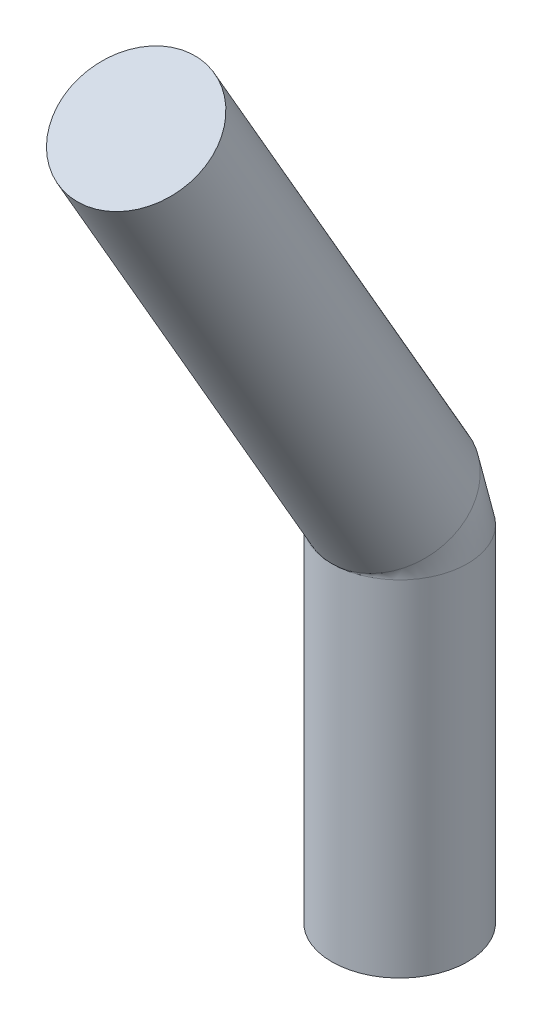
ISO-10303-21;
HEADER;
FILE_DESCRIPTION(('STEP AP214'),'2;1');
FILE_NAME('part.step','',(''),(''),'','','');
FILE_SCHEMA(('AUTOMOTIVE_DESIGN { 1 0 10303 214 1 1 1 1 }'));
ENDSEC;
DATA;
#1=APPLICATION_CONTEXT('core data for automotive mechanical design processes');
#2=APPLICATION_PROTOCOL_DEFINITION('international standard','automotive_design',2000,#1);
#3=PRODUCT_CONTEXT('',#1,'mechanical');
#4=PRODUCT('Part','Part','',(#3));
#5=PRODUCT_RELATED_PRODUCT_CATEGORY('part','',(#4));
#6=PRODUCT_DEFINITION_FORMATION('','',#4);
#7=PRODUCT_DEFINITION_CONTEXT('part definition',#1,'design');
#8=PRODUCT_DEFINITION('design','',#6,#7);
#9=PRODUCT_DEFINITION_SHAPE('','',#8);
#10=(LENGTH_UNIT() NAMED_UNIT(*) SI_UNIT(.MILLI.,.METRE.));
#11=(NAMED_UNIT(*) PLANE_ANGLE_UNIT() SI_UNIT($,.RADIAN.));
#12=(NAMED_UNIT(*) SI_UNIT($,.STERADIAN.) SOLID_ANGLE_UNIT());
#13=UNCERTAINTY_MEASURE_WITH_UNIT(LENGTH_MEASURE(1.E-05),#10,'distance_accuracy_value','');
#14=(GEOMETRIC_REPRESENTATION_CONTEXT(3) GLOBAL_UNCERTAINTY_ASSIGNED_CONTEXT((#13)) GLOBAL_UNIT_ASSIGNED_CONTEXT((#10,
#11,#12)) REPRESENTATION_CONTEXT('',''));
#15=CARTESIAN_POINT('',(0.,0.,0.));
#16=DIRECTION('',(0.,0.,1.));
#17=DIRECTION('',(1.,0.,0.));
#18=AXIS2_PLACEMENT_3D('',#15,#16,#17);
#19=CARTESIAN_POINT('',(0.,4.69711431702997,2.33038475772934));
#20=DIRECTION('',(0.,0.866025403784438,0.500000000000001));
#21=DIRECTION('',(0.,-0.500000000000001,0.866025403784438));
#22=AXIS2_PLACEMENT_3D('',#19,#20,#21);
#23=PLANE('',#22);
#24=CARTESIAN_POINT('',(0.,4.69711431702997,2.33038475772934));
#25=DIRECTION('',(0.,0.866025403784438,0.500000000000001));
#26=DIRECTION('',(0.,-0.500000000000001,0.866025403784438));
#27=AXIS2_PLACEMENT_3D('',#24,#25,#26);
#28=CIRCLE('',#27,0.6);
#29=CARTESIAN_POINT('',(0.,4.39711431702997,2.85000000000001));
#30=VERTEX_POINT('',#29);
#31=EDGE_CURVE('E11',#30,#30,#28,.T.);
#32=ORIENTED_EDGE('',*,*,#31,.T.);
#33=EDGE_LOOP('',(#32));
#34=FACE_BOUND('',#33,.T.);
#35=ADVANCED_FACE('F40',(#34),#23,.T.);
#36=CARTESIAN_POINT('',(0.,0.,0.));
#37=DIRECTION('',(0.,1.,0.));
#38=DIRECTION('',(0.,0.,1.));
#39=AXIS2_PLACEMENT_3D('',#36,#37,#38);
#40=CYLINDRICAL_SURFACE('',#39,0.6);
#41=CARTESIAN_POINT('',(0.,0.5,0.));
#42=DIRECTION('',(0.,1.,0.));
#43=DIRECTION('',(0.,0.,1.));
#44=AXIS2_PLACEMENT_3D('',#41,#42,#43);
#45=CIRCLE('',#44,0.6);
#46=CARTESIAN_POINT('',(0.,0.5,0.6));
#47=VERTEX_POINT('',#46);
#48=EDGE_CURVE('E51',#47,#47,#45,.T.);
#49=ORIENTED_EDGE('',*,*,#48,.F.);
#50=EDGE_LOOP('',(#49));
#51=FACE_BOUND('',#50,.T.);
#52=CARTESIAN_POINT('',(0.,-2.55,0.));
#53=DIRECTION('',(0.,-1.,0.));
#54=DIRECTION('',(0.,0.,-1.));
#55=AXIS2_PLACEMENT_3D('',#52,#53,#54);
#56=CIRCLE('',#55,0.6);
#57=CARTESIAN_POINT('',(0.,-2.55,-0.6));
#58=VERTEX_POINT('',#57);
#59=EDGE_CURVE('E58',#58,#58,#56,.T.);
#60=ORIENTED_EDGE('',*,*,#59,.F.);
#61=EDGE_LOOP('',(#60));
#62=FACE_BOUND('',#61,.T.);
#63=ADVANCED_FACE('F52',(#51,#62),#40,.T.);
#64=CARTESIAN_POINT('',(0.,0.5,0.6));
#65=DIRECTION('',(1.,0.,0.));
#66=DIRECTION('',(0.,0.,-1.));
#67=AXIS2_PLACEMENT_3D('',#64,#65,#66);
#68=DEGENERATE_TOROIDAL_SURFACE('',#67,0.6,0.6,.T.);
#69=CARTESIAN_POINT('',(0.,0.800000000000001,0.0803847577293372));
#70=DIRECTION('',(0.,0.866025403784438,0.500000000000001));
#71=DIRECTION('',(0.,-0.500000000000001,0.866025403784438));
#72=AXIS2_PLACEMENT_3D('',#69,#70,#71);
#73=CIRCLE('',#72,0.6);
#74=EDGE_CURVE('E47',#47,#47,#73,.T.);
#75=ORIENTED_EDGE('',*,*,#74,.F.);
#76=ORIENTED_EDGE('',*,*,#48,.T.);
#77=EDGE_LOOP('',(#75,#76));
#78=FACE_BOUND('',#77,.T.);
#79=ADVANCED_FACE('F68',(#78),#68,.T.);
#80=CARTESIAN_POINT('',(0.,0.800000000000001,0.0803847577293372));
#81=DIRECTION('',(0.,0.866025403784438,0.500000000000001));
#82=DIRECTION('',(0.,-0.500000000000001,0.866025403784438));
#83=AXIS2_PLACEMENT_3D('',#80,#81,#82);
#84=CYLINDRICAL_SURFACE('',#83,0.6);
#85=ORIENTED_EDGE('',*,*,#31,.F.);
#86=EDGE_LOOP('',(#85));
#87=FACE_BOUND('',#86,.T.);
#88=ORIENTED_EDGE('',*,*,#74,.T.);
#89=EDGE_LOOP('',(#88));
#90=FACE_BOUND('',#89,.T.);
#91=ADVANCED_FACE('F74',(#87,#90),#84,.T.);
#92=CARTESIAN_POINT('',(0.,-2.55,0.));
#93=DIRECTION('',(0.,-1.,0.));
#94=DIRECTION('',(0.,0.,-1.));
#95=AXIS2_PLACEMENT_3D('',#92,#93,#94);
#96=PLANE('',#95);
#97=ORIENTED_EDGE('',*,*,#59,.T.);
#98=EDGE_LOOP('',(#97));
#99=FACE_BOUND('',#98,.T.);
#100=ADVANCED_FACE('F66',(#99),#96,.T.);
#101=CLOSED_SHELL('',(#35,#63,#79,#91,#100));
#102=MANIFOLD_SOLID_BREP('B2',#101);
#103=ADVANCED_BREP_SHAPE_REPRESENTATION('',(#18,#102),#14);
#104=SHAPE_DEFINITION_REPRESENTATION(#9,#103);
ENDSEC;
END-ISO-10303-21;
